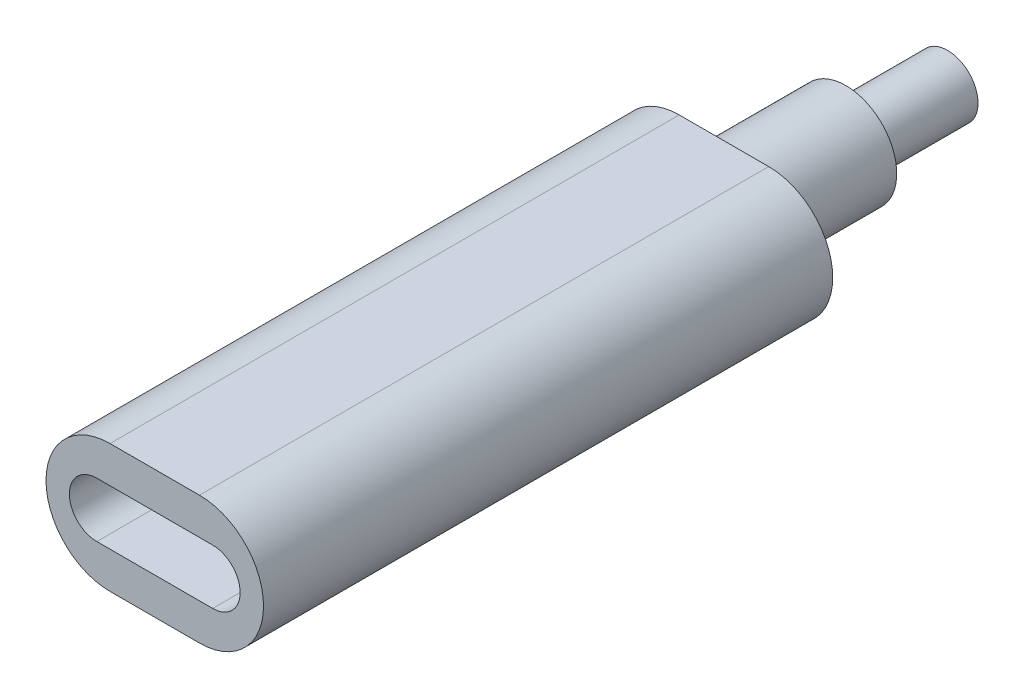
ISO-10303-21;
HEADER;
FILE_DESCRIPTION(('STEP AP214'),'2;1');
FILE_NAME('part.step','',(''),(''),'','','');
FILE_SCHEMA(('AUTOMOTIVE_DESIGN { 1 0 10303 214 1 1 1 1 }'));
ENDSEC;
DATA;
#1=APPLICATION_CONTEXT('core data for automotive mechanical design processes');
#2=APPLICATION_PROTOCOL_DEFINITION('international standard','automotive_design',2000,#1);
#3=PRODUCT_CONTEXT('',#1,'mechanical');
#4=PRODUCT('Part','Part','',(#3));
#5=PRODUCT_RELATED_PRODUCT_CATEGORY('part','',(#4));
#6=PRODUCT_DEFINITION_FORMATION('','',#4);
#7=PRODUCT_DEFINITION_CONTEXT('part definition',#1,'design');
#8=PRODUCT_DEFINITION('design','',#6,#7);
#9=PRODUCT_DEFINITION_SHAPE('','',#8);
#10=(LENGTH_UNIT() NAMED_UNIT(*) SI_UNIT(.MILLI.,.METRE.));
#11=(NAMED_UNIT(*) PLANE_ANGLE_UNIT() SI_UNIT($,.RADIAN.));
#12=(NAMED_UNIT(*) SI_UNIT($,.STERADIAN.) SOLID_ANGLE_UNIT());
#13=UNCERTAINTY_MEASURE_WITH_UNIT(LENGTH_MEASURE(1.E-05),#10,'distance_accuracy_value','');
#14=(GEOMETRIC_REPRESENTATION_CONTEXT(3) GLOBAL_UNCERTAINTY_ASSIGNED_CONTEXT((#13)) GLOBAL_UNIT_ASSIGNED_CONTEXT((#10,
#11,#12)) REPRESENTATION_CONTEXT('',''));
#15=CARTESIAN_POINT('',(0.,0.,0.));
#16=DIRECTION('',(0.,0.,1.));
#17=DIRECTION('',(1.,0.,0.));
#18=AXIS2_PLACEMENT_3D('',#15,#16,#17);
#19=CARTESIAN_POINT('',(2.2,0.,-28.));
#20=DIRECTION('',(0.,0.,1.));
#21=DIRECTION('',(1.,0.,0.));
#22=AXIS2_PLACEMENT_3D('',#19,#20,#21);
#23=CYLINDRICAL_SURFACE('',#22,3.15);
#24=CARTESIAN_POINT('',(2.2,0.,0.));
#25=DIRECTION('',(0.,0.,1.));
#26=DIRECTION('',(1.,0.,0.));
#27=AXIS2_PLACEMENT_3D('',#24,#25,#26);
#28=CIRCLE('',#27,3.15);
#29=CARTESIAN_POINT('',(2.2,-3.15,0.));
#30=VERTEX_POINT('',#29);
#31=CARTESIAN_POINT('',(2.2,3.15,0.));
#32=VERTEX_POINT('',#31);
#33=EDGE_CURVE('E144',#30,#32,#28,.T.);
#34=ORIENTED_EDGE('',*,*,#33,.F.);
#35=DIRECTION('',(0.,0.,1.));
#36=VECTOR('',#35,1.);
#37=CARTESIAN_POINT('',(2.2,-3.15,-28.));
#38=LINE('',#37,#36);
#39=CARTESIAN_POINT('',(2.2,-3.15,-28.));
#40=VERTEX_POINT('',#39);
#41=EDGE_CURVE('E58',#40,#30,#38,.T.);
#42=ORIENTED_EDGE('',*,*,#41,.F.);
#43=CARTESIAN_POINT('',(2.2,0.,-28.));
#44=DIRECTION('',(0.,0.,1.));
#45=DIRECTION('',(1.,0.,0.));
#46=AXIS2_PLACEMENT_3D('',#43,#44,#45);
#47=CIRCLE('',#46,3.15);
#48=CARTESIAN_POINT('',(2.2,3.15,-28.));
#49=VERTEX_POINT('',#48);
#50=EDGE_CURVE('E148',#40,#49,#47,.T.);
#51=ORIENTED_EDGE('',*,*,#50,.T.);
#52=DIRECTION('',(0.,0.,1.));
#53=VECTOR('',#52,1.);
#54=CARTESIAN_POINT('',(2.2,3.15,-28.));
#55=LINE('',#54,#53);
#56=EDGE_CURVE('E36',#49,#32,#55,.T.);
#57=ORIENTED_EDGE('',*,*,#56,.T.);
#58=EDGE_LOOP('',(#34,#42,#51,#57));
#59=FACE_BOUND('',#58,.T.);
#60=ADVANCED_FACE('F33',(#59),#23,.T.);
#61=CARTESIAN_POINT('',(2.2,-3.15,-28.));
#62=DIRECTION('',(0.,1.,0.));
#63=DIRECTION('',(-1.,0.,0.));
#64=AXIS2_PLACEMENT_3D('',#61,#62,#63);
#65=PLANE('',#64);
#66=DIRECTION('',(-1.,0.,0.));
#67=VECTOR('',#66,1.);
#68=CARTESIAN_POINT('',(2.2,-3.15,0.));
#69=LINE('',#68,#67);
#70=CARTESIAN_POINT('',(-2.2,-3.15,0.));
#71=VERTEX_POINT('',#70);
#72=EDGE_CURVE('E151',#30,#71,#69,.T.);
#73=ORIENTED_EDGE('',*,*,#72,.T.);
#74=DIRECTION('',(0.,0.,1.));
#75=VECTOR('',#74,1.);
#76=CARTESIAN_POINT('',(-2.2,-3.15,-28.));
#77=LINE('',#76,#75);
#78=CARTESIAN_POINT('',(-2.2,-3.15,-28.));
#79=VERTEX_POINT('',#78);
#80=EDGE_CURVE('E168',#79,#71,#77,.T.);
#81=ORIENTED_EDGE('',*,*,#80,.F.);
#82=DIRECTION('',(-1.,0.,0.));
#83=VECTOR('',#82,1.);
#84=CARTESIAN_POINT('',(2.2,-3.15,-28.));
#85=LINE('',#84,#83);
#86=EDGE_CURVE('E156',#40,#79,#85,.T.);
#87=ORIENTED_EDGE('',*,*,#86,.F.);
#88=ORIENTED_EDGE('',*,*,#41,.T.);
#89=EDGE_LOOP('',(#73,#81,#87,#88));
#90=FACE_BOUND('',#89,.T.);
#91=ADVANCED_FACE('F176',(#90),#65,.F.);
#92=CARTESIAN_POINT('',(-2.2,0.,-28.));
#93=DIRECTION('',(0.,0.,1.));
#94=DIRECTION('',(1.,0.,0.));
#95=AXIS2_PLACEMENT_3D('',#92,#93,#94);
#96=CYLINDRICAL_SURFACE('',#95,3.15);
#97=CARTESIAN_POINT('',(-2.2,0.,0.));
#98=DIRECTION('',(0.,0.,1.));
#99=DIRECTION('',(1.,0.,0.));
#100=AXIS2_PLACEMENT_3D('',#97,#98,#99);
#101=CIRCLE('',#100,3.15);
#102=CARTESIAN_POINT('',(-2.2,3.15,0.));
#103=VERTEX_POINT('',#102);
#104=EDGE_CURVE('E163',#103,#71,#101,.T.);
#105=ORIENTED_EDGE('',*,*,#104,.F.);
#106=DIRECTION('',(0.,0.,1.));
#107=VECTOR('',#106,1.);
#108=CARTESIAN_POINT('',(-2.2,3.15,-28.));
#109=LINE('',#108,#107);
#110=CARTESIAN_POINT('',(-2.2,3.15,-28.));
#111=VERTEX_POINT('',#110);
#112=EDGE_CURVE('E169',#111,#103,#109,.T.);
#113=ORIENTED_EDGE('',*,*,#112,.F.);
#114=CARTESIAN_POINT('',(-2.2,0.,-28.));
#115=DIRECTION('',(0.,0.,1.));
#116=DIRECTION('',(1.,0.,0.));
#117=AXIS2_PLACEMENT_3D('',#114,#115,#116);
#118=CIRCLE('',#117,3.15);
#119=EDGE_CURVE('E153',#111,#79,#118,.T.);
#120=ORIENTED_EDGE('',*,*,#119,.T.);
#121=ORIENTED_EDGE('',*,*,#80,.T.);
#122=EDGE_LOOP('',(#105,#113,#120,#121));
#123=FACE_BOUND('',#122,.T.);
#124=ADVANCED_FACE('F179',(#123),#96,.T.);
#125=CARTESIAN_POINT('',(2.2,3.15,-28.));
#126=DIRECTION('',(0.,1.,0.));
#127=DIRECTION('',(-1.,0.,0.));
#128=AXIS2_PLACEMENT_3D('',#125,#126,#127);
#129=PLANE('',#128);
#130=DIRECTION('',(-1.,0.,0.));
#131=VECTOR('',#130,1.);
#132=CARTESIAN_POINT('',(2.2,3.15,0.));
#133=LINE('',#132,#131);
#134=EDGE_CURVE('E160',#32,#103,#133,.T.);
#135=ORIENTED_EDGE('',*,*,#134,.F.);
#136=ORIENTED_EDGE('',*,*,#56,.F.);
#137=DIRECTION('',(-1.,0.,0.));
#138=VECTOR('',#137,1.);
#139=CARTESIAN_POINT('',(2.2,3.15,-28.));
#140=LINE('',#139,#138);
#141=EDGE_CURVE('E150',#49,#111,#140,.T.);
#142=ORIENTED_EDGE('',*,*,#141,.T.);
#143=ORIENTED_EDGE('',*,*,#112,.T.);
#144=EDGE_LOOP('',(#135,#136,#142,#143));
#145=FACE_BOUND('',#144,.T.);
#146=ADVANCED_FACE('F172',(#145),#129,.T.);
#147=CARTESIAN_POINT('',(2.2,0.,-28.));
#148=DIRECTION('',(0.,0.,1.));
#149=DIRECTION('',(1.,0.,0.));
#150=AXIS2_PLACEMENT_3D('',#147,#148,#149);
#151=PLANE('',#150);
#152=CARTESIAN_POINT('',(0.,0.,-28.));
#153=DIRECTION('',(0.,0.,-1.));
#154=DIRECTION('',(-1.,0.,0.));
#155=AXIS2_PLACEMENT_3D('',#152,#153,#154);
#156=CIRCLE('',#155,2.5);
#157=CARTESIAN_POINT('',(-2.5,0.,-28.));
#158=VERTEX_POINT('',#157);
#159=EDGE_CURVE('E41',#158,#158,#156,.T.);
#160=ORIENTED_EDGE('',*,*,#159,.F.);
#161=EDGE_LOOP('',(#160));
#162=FACE_BOUND('',#161,.T.);
#163=ORIENTED_EDGE('',*,*,#50,.F.);
#164=ORIENTED_EDGE('',*,*,#86,.T.);
#165=ORIENTED_EDGE('',*,*,#119,.F.);
#166=ORIENTED_EDGE('',*,*,#141,.F.);
#167=EDGE_LOOP('',(#163,#164,#165,#166));
#168=FACE_BOUND('',#167,.T.);
#169=ADVANCED_FACE('F181',(#162,#168),#151,.F.);
#170=CARTESIAN_POINT('',(2.2,0.,0.));
#171=DIRECTION('',(0.,0.,1.));
#172=DIRECTION('',(1.,0.,0.));
#173=AXIS2_PLACEMENT_3D('',#170,#171,#172);
#174=PLANE('',#173);
#175=CARTESIAN_POINT('',(2.85,0.,0.));
#176=DIRECTION('',(0.,0.,1.));
#177=DIRECTION('',(1.,0.,0.));
#178=AXIS2_PLACEMENT_3D('',#175,#176,#177);
#179=CIRCLE('',#178,1.35);
#180=CARTESIAN_POINT('',(2.85,-1.35,0.));
#181=VERTEX_POINT('',#180);
#182=CARTESIAN_POINT('',(2.85,1.35,0.));
#183=VERTEX_POINT('',#182);
#184=EDGE_CURVE('E49',#181,#183,#179,.T.);
#185=ORIENTED_EDGE('',*,*,#184,.F.);
#186=DIRECTION('',(-1.,0.,0.));
#187=VECTOR('',#186,1.);
#188=CARTESIAN_POINT('',(2.85,-1.35,0.));
#189=LINE('',#188,#187);
#190=CARTESIAN_POINT('',(-2.85,-1.35,0.));
#191=VERTEX_POINT('',#190);
#192=EDGE_CURVE('E126',#181,#191,#189,.T.);
#193=ORIENTED_EDGE('',*,*,#192,.T.);
#194=CARTESIAN_POINT('',(-2.85,0.,0.));
#195=DIRECTION('',(0.,0.,1.));
#196=DIRECTION('',(1.,0.,0.));
#197=AXIS2_PLACEMENT_3D('',#194,#195,#196);
#198=CIRCLE('',#197,1.35);
#199=CARTESIAN_POINT('',(-2.85,1.35,0.));
#200=VERTEX_POINT('',#199);
#201=EDGE_CURVE('E129',#200,#191,#198,.T.);
#202=ORIENTED_EDGE('',*,*,#201,.F.);
#203=DIRECTION('',(-1.,0.,0.));
#204=VECTOR('',#203,1.);
#205=CARTESIAN_POINT('',(2.85,1.35,0.));
#206=LINE('',#205,#204);
#207=EDGE_CURVE('E137',#183,#200,#206,.T.);
#208=ORIENTED_EDGE('',*,*,#207,.F.);
#209=EDGE_LOOP('',(#185,#193,#202,#208));
#210=FACE_BOUND('',#209,.T.);
#211=ORIENTED_EDGE('',*,*,#33,.T.);
#212=ORIENTED_EDGE('',*,*,#134,.T.);
#213=ORIENTED_EDGE('',*,*,#104,.T.);
#214=ORIENTED_EDGE('',*,*,#72,.F.);
#215=EDGE_LOOP('',(#211,#212,#213,#214));
#216=FACE_BOUND('',#215,.T.);
#217=ADVANCED_FACE('F174',(#210,#216),#174,.T.);
#218=CARTESIAN_POINT('',(2.85,0.,-5.));
#219=DIRECTION('',(0.,0.,1.));
#220=DIRECTION('',(1.,0.,0.));
#221=AXIS2_PLACEMENT_3D('',#218,#219,#220);
#222=CYLINDRICAL_SURFACE('',#221,1.35);
#223=ORIENTED_EDGE('',*,*,#184,.T.);
#224=DIRECTION('',(0.,0.,1.));
#225=VECTOR('',#224,1.);
#226=CARTESIAN_POINT('',(2.85,1.35,-5.));
#227=LINE('',#226,#225);
#228=CARTESIAN_POINT('',(2.85,1.35,-5.));
#229=VERTEX_POINT('',#228);
#230=EDGE_CURVE('E105',#229,#183,#227,.T.);
#231=ORIENTED_EDGE('',*,*,#230,.F.);
#232=CARTESIAN_POINT('',(2.85,0.,-5.));
#233=DIRECTION('',(0.,0.,1.));
#234=DIRECTION('',(1.,0.,0.));
#235=AXIS2_PLACEMENT_3D('',#232,#233,#234);
#236=CIRCLE('',#235,1.35);
#237=CARTESIAN_POINT('',(2.85,-1.35,-5.));
#238=VERTEX_POINT('',#237);
#239=EDGE_CURVE('E109',#238,#229,#236,.T.);
#240=ORIENTED_EDGE('',*,*,#239,.F.);
#241=DIRECTION('',(0.,0.,1.));
#242=VECTOR('',#241,1.);
#243=CARTESIAN_POINT('',(2.85,-1.35,-5.));
#244=LINE('',#243,#242);
#245=EDGE_CURVE('E142',#238,#181,#244,.T.);
#246=ORIENTED_EDGE('',*,*,#245,.T.);
#247=EDGE_LOOP('',(#223,#231,#240,#246));
#248=FACE_BOUND('',#247,.T.);
#249=ADVANCED_FACE('F107',(#248),#222,.F.);
#250=CARTESIAN_POINT('',(2.85,-1.35,-5.));
#251=DIRECTION('',(0.,1.,0.));
#252=DIRECTION('',(-1.,0.,0.));
#253=AXIS2_PLACEMENT_3D('',#250,#251,#252);
#254=PLANE('',#253);
#255=ORIENTED_EDGE('',*,*,#192,.F.);
#256=ORIENTED_EDGE('',*,*,#245,.F.);
#257=DIRECTION('',(-1.,0.,0.));
#258=VECTOR('',#257,1.);
#259=CARTESIAN_POINT('',(2.85,-1.35,-5.));
#260=LINE('',#259,#258);
#261=CARTESIAN_POINT('',(-2.85,-1.35,-5.));
#262=VERTEX_POINT('',#261);
#263=EDGE_CURVE('E114',#238,#262,#260,.T.);
#264=ORIENTED_EDGE('',*,*,#263,.T.);
#265=DIRECTION('',(0.,0.,1.));
#266=VECTOR('',#265,1.);
#267=CARTESIAN_POINT('',(-2.85,-1.35,-5.));
#268=LINE('',#267,#266);
#269=EDGE_CURVE('E145',#262,#191,#268,.T.);
#270=ORIENTED_EDGE('',*,*,#269,.T.);
#271=EDGE_LOOP('',(#255,#256,#264,#270));
#272=FACE_BOUND('',#271,.T.);
#273=ADVANCED_FACE('F224',(#272),#254,.T.);
#274=CARTESIAN_POINT('',(-2.85,0.,-5.));
#275=DIRECTION('',(0.,0.,1.));
#276=DIRECTION('',(1.,0.,0.));
#277=AXIS2_PLACEMENT_3D('',#274,#275,#276);
#278=CYLINDRICAL_SURFACE('',#277,1.35);
#279=ORIENTED_EDGE('',*,*,#201,.T.);
#280=ORIENTED_EDGE('',*,*,#269,.F.);
#281=CARTESIAN_POINT('',(-2.85,0.,-5.));
#282=DIRECTION('',(0.,0.,1.));
#283=DIRECTION('',(1.,0.,0.));
#284=AXIS2_PLACEMENT_3D('',#281,#282,#283);
#285=CIRCLE('',#284,1.35);
#286=CARTESIAN_POINT('',(-2.85,1.35,-5.));
#287=VERTEX_POINT('',#286);
#288=EDGE_CURVE('E122',#287,#262,#285,.T.);
#289=ORIENTED_EDGE('',*,*,#288,.F.);
#290=DIRECTION('',(0.,0.,1.));
#291=VECTOR('',#290,1.);
#292=CARTESIAN_POINT('',(-2.85,1.35,-5.));
#293=LINE('',#292,#291);
#294=EDGE_CURVE('E113',#287,#200,#293,.T.);
#295=ORIENTED_EDGE('',*,*,#294,.T.);
#296=EDGE_LOOP('',(#279,#280,#289,#295));
#297=FACE_BOUND('',#296,.T.);
#298=ADVANCED_FACE('F232',(#297),#278,.F.);
#299=CARTESIAN_POINT('',(2.85,1.35,-5.));
#300=DIRECTION('',(0.,1.,0.));
#301=DIRECTION('',(-1.,0.,0.));
#302=AXIS2_PLACEMENT_3D('',#299,#300,#301);
#303=PLANE('',#302);
#304=ORIENTED_EDGE('',*,*,#207,.T.);
#305=ORIENTED_EDGE('',*,*,#294,.F.);
#306=DIRECTION('',(-1.,0.,0.));
#307=VECTOR('',#306,1.);
#308=CARTESIAN_POINT('',(2.85,1.35,-5.));
#309=LINE('',#308,#307);
#310=EDGE_CURVE('E117',#229,#287,#309,.T.);
#311=ORIENTED_EDGE('',*,*,#310,.F.);
#312=ORIENTED_EDGE('',*,*,#230,.T.);
#313=EDGE_LOOP('',(#304,#305,#311,#312));
#314=FACE_BOUND('',#313,.T.);
#315=ADVANCED_FACE('F118',(#314),#303,.F.);
#316=CARTESIAN_POINT('',(2.85,0.,-5.));
#317=DIRECTION('',(0.,0.,1.));
#318=DIRECTION('',(1.,0.,0.));
#319=AXIS2_PLACEMENT_3D('',#316,#317,#318);
#320=PLANE('',#319);
#321=ORIENTED_EDGE('',*,*,#239,.T.);
#322=ORIENTED_EDGE('',*,*,#310,.T.);
#323=ORIENTED_EDGE('',*,*,#288,.T.);
#324=ORIENTED_EDGE('',*,*,#263,.F.);
#325=EDGE_LOOP('',(#321,#322,#323,#324));
#326=FACE_BOUND('',#325,.T.);
#327=ADVANCED_FACE('F125',(#326),#320,.T.);
#328=CARTESIAN_POINT('',(0.,0.,-34.));
#329=DIRECTION('',(0.,0.,1.));
#330=DIRECTION('',(1.,0.,0.));
#331=AXIS2_PLACEMENT_3D('',#328,#329,#330);
#332=CYLINDRICAL_SURFACE('',#331,2.5);
#333=CARTESIAN_POINT('',(0.,0.,-34.));
#334=DIRECTION('',(0.,0.,-1.));
#335=DIRECTION('',(-1.,0.,0.));
#336=AXIS2_PLACEMENT_3D('',#333,#334,#335);
#337=CIRCLE('',#336,2.5);
#338=CARTESIAN_POINT('',(-2.5,0.,-34.));
#339=VERTEX_POINT('',#338);
#340=EDGE_CURVE('E138',#339,#339,#337,.T.);
#341=ORIENTED_EDGE('',*,*,#340,.F.);
#342=EDGE_LOOP('',(#341));
#343=FACE_BOUND('',#342,.T.);
#344=ORIENTED_EDGE('',*,*,#159,.T.);
#345=EDGE_LOOP('',(#344));
#346=FACE_BOUND('',#345,.T.);
#347=ADVANCED_FACE('F258',(#343,#346),#332,.T.);
#348=CARTESIAN_POINT('',(0.,0.,-34.));
#349=DIRECTION('',(0.,0.,-1.));
#350=DIRECTION('',(-1.,0.,0.));
#351=AXIS2_PLACEMENT_3D('',#348,#349,#350);
#352=PLANE('',#351);
#353=CARTESIAN_POINT('',(0.,0.,-34.));
#354=DIRECTION('',(0.,0.,-1.));
#355=DIRECTION('',(-1.,0.,0.));
#356=AXIS2_PLACEMENT_3D('',#353,#354,#355);
#357=CIRCLE('',#356,1.5);
#358=CARTESIAN_POINT('',(-1.5,0.,-34.));
#359=VERTEX_POINT('',#358);
#360=EDGE_CURVE('E11',#359,#359,#357,.T.);
#361=ORIENTED_EDGE('',*,*,#360,.F.);
#362=EDGE_LOOP('',(#361));
#363=FACE_BOUND('',#362,.T.);
#364=ORIENTED_EDGE('',*,*,#340,.T.);
#365=EDGE_LOOP('',(#364));
#366=FACE_BOUND('',#365,.T.);
#367=ADVANCED_FACE('F271',(#363,#366),#352,.T.);
#368=CARTESIAN_POINT('',(0.,0.,-39.));
#369=DIRECTION('',(0.,0.,1.));
#370=DIRECTION('',(1.,0.,0.));
#371=AXIS2_PLACEMENT_3D('',#368,#369,#370);
#372=CYLINDRICAL_SURFACE('',#371,1.5);
#373=CARTESIAN_POINT('',(0.,0.,-39.));
#374=DIRECTION('',(0.,0.,-1.));
#375=DIRECTION('',(-1.,0.,0.));
#376=AXIS2_PLACEMENT_3D('',#373,#374,#375);
#377=CIRCLE('',#376,1.5);
#378=CARTESIAN_POINT('',(-1.5,0.,-39.));
#379=VERTEX_POINT('',#378);
#380=EDGE_CURVE('E307',#379,#379,#377,.T.);
#381=ORIENTED_EDGE('',*,*,#380,.F.);
#382=EDGE_LOOP('',(#381));
#383=FACE_BOUND('',#382,.T.);
#384=ORIENTED_EDGE('',*,*,#360,.T.);
#385=EDGE_LOOP('',(#384));
#386=FACE_BOUND('',#385,.T.);
#387=ADVANCED_FACE('F281',(#383,#386),#372,.T.);
#388=CARTESIAN_POINT('',(0.,0.,-39.));
#389=DIRECTION('',(0.,0.,-1.));
#390=DIRECTION('',(-1.,0.,0.));
#391=AXIS2_PLACEMENT_3D('',#388,#389,#390);
#392=PLANE('',#391);
#393=ORIENTED_EDGE('',*,*,#380,.T.);
#394=EDGE_LOOP('',(#393));
#395=FACE_BOUND('',#394,.T.);
#396=ADVANCED_FACE('F291',(#395),#392,.T.);
#397=CLOSED_SHELL('',(#60,#91,#124,#146,#169,#217,#249,#273,#298,#315,#327,#347,#367,#387,#396));
#398=MANIFOLD_SOLID_BREP('B2',#397);
#399=ADVANCED_BREP_SHAPE_REPRESENTATION('',(#18,#398),#14);
#400=SHAPE_DEFINITION_REPRESENTATION(#9,#399);
ENDSEC;
END-ISO-10303-21;
